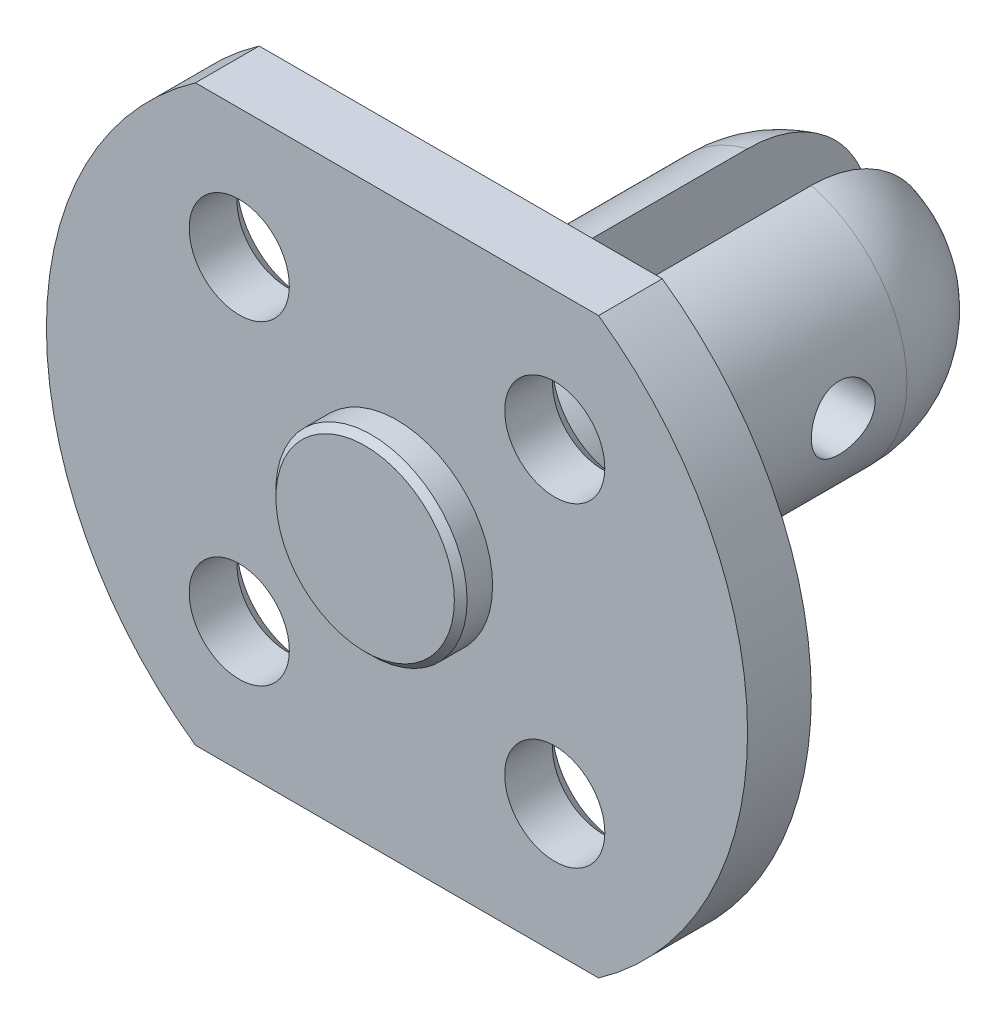
ISO-10303-21;
HEADER;
FILE_DESCRIPTION(('STEP AP214'),'2;1');
FILE_NAME('part.step','',(''),(''),'','','');
FILE_SCHEMA(('AUTOMOTIVE_DESIGN { 1 0 10303 214 1 1 1 1 }'));
ENDSEC;
DATA;
#1=APPLICATION_CONTEXT('core data for automotive mechanical design processes');
#2=APPLICATION_PROTOCOL_DEFINITION('international standard','automotive_design',2000,#1);
#3=PRODUCT_CONTEXT('',#1,'mechanical');
#4=PRODUCT('Part','Part','',(#3));
#5=PRODUCT_RELATED_PRODUCT_CATEGORY('part','',(#4));
#6=PRODUCT_DEFINITION_FORMATION('','',#4);
#7=PRODUCT_DEFINITION_CONTEXT('part definition',#1,'design');
#8=PRODUCT_DEFINITION('design','',#6,#7);
#9=PRODUCT_DEFINITION_SHAPE('','',#8);
#10=(LENGTH_UNIT() NAMED_UNIT(*) SI_UNIT(.MILLI.,.METRE.));
#11=(NAMED_UNIT(*) PLANE_ANGLE_UNIT() SI_UNIT($,.RADIAN.));
#12=(NAMED_UNIT(*) SI_UNIT($,.STERADIAN.) SOLID_ANGLE_UNIT());
#13=UNCERTAINTY_MEASURE_WITH_UNIT(LENGTH_MEASURE(1.E-05),#10,'distance_accuracy_value','');
#14=(GEOMETRIC_REPRESENTATION_CONTEXT(3) GLOBAL_UNCERTAINTY_ASSIGNED_CONTEXT((#13)) GLOBAL_UNIT_ASSIGNED_CONTEXT((#10,
#11,#12)) REPRESENTATION_CONTEXT('',''));
#15=CARTESIAN_POINT('',(0.,0.,0.));
#16=DIRECTION('',(0.,0.,1.));
#17=DIRECTION('',(1.,0.,0.));
#18=AXIS2_PLACEMENT_3D('',#15,#16,#17);
#19=CARTESIAN_POINT('',(0.,0.,-10.));
#20=DIRECTION('',(0.,0.,1.));
#21=DIRECTION('',(1.,0.,0.));
#22=AXIS2_PLACEMENT_3D('',#19,#20,#21);
#23=SPHERICAL_SURFACE('',#22,4.);
#24=CARTESIAN_POINT('',(1.,0.,-10.));
#25=DIRECTION('',(1.,0.,0.));
#26=DIRECTION('',(0.,0.,-1.));
#27=AXIS2_PLACEMENT_3D('',#24,#25,#26);
#28=CIRCLE('',#27,3.87298334620742);
#29=CARTESIAN_POINT('',(1.,3.87298334620742,-10.));
#30=VERTEX_POINT('',#29);
#31=CARTESIAN_POINT('',(1.,-3.87298334620742,-10.));
#32=VERTEX_POINT('',#31);
#33=EDGE_CURVE('E215',#30,#32,#28,.F.);
#34=ORIENTED_EDGE('',*,*,#33,.F.);
#35=CARTESIAN_POINT('',(0.,0.,-10.));
#36=DIRECTION('',(0.,0.,1.));
#37=DIRECTION('',(1.,0.,0.));
#38=AXIS2_PLACEMENT_3D('',#35,#36,#37);
#39=CIRCLE('',#38,4.);
#40=EDGE_CURVE('E148',#32,#30,#39,.T.);
#41=ORIENTED_EDGE('',*,*,#40,.F.);
#42=EDGE_LOOP('',(#34,#41));
#43=FACE_BOUND('',#42,.T.);
#44=ADVANCED_FACE('F43',(#43),#23,.T.);
#45=CARTESIAN_POINT('',(0.,0.,2.));
#46=DIRECTION('',(0.,0.,-1.));
#47=DIRECTION('',(-1.,0.,0.));
#48=AXIS2_PLACEMENT_3D('',#45,#46,#47);
#49=CYLINDRICAL_SURFACE('',#48,11.);
#50=CARTESIAN_POINT('',(0.,0.,0.));
#51=DIRECTION('',(0.,0.,1.));
#52=DIRECTION('',(1.,0.,0.));
#53=AXIS2_PLACEMENT_3D('',#50,#51,#52);
#54=CIRCLE('',#53,11.);
#55=CARTESIAN_POINT('',(-6.32455532033676,8.99999999999999,0.));
#56=VERTEX_POINT('',#55);
#57=CARTESIAN_POINT('',(-6.32455532033675,-9.,0.));
#58=VERTEX_POINT('',#57);
#59=EDGE_CURVE('E166',#56,#58,#54,.T.);
#60=ORIENTED_EDGE('',*,*,#59,.T.);
#61=DIRECTION('',(0.,0.,-1.));
#62=VECTOR('',#61,1.);
#63=CARTESIAN_POINT('',(-6.32455532033675,-9.,2.));
#64=LINE('',#63,#62);
#65=CARTESIAN_POINT('',(-6.32455532033675,-9.,2.));
#66=VERTEX_POINT('',#65);
#67=EDGE_CURVE('E187',#66,#58,#64,.T.);
#68=ORIENTED_EDGE('',*,*,#67,.F.);
#69=CARTESIAN_POINT('',(0.,0.,2.));
#70=DIRECTION('',(0.,0.,1.));
#71=DIRECTION('',(1.,0.,0.));
#72=AXIS2_PLACEMENT_3D('',#69,#70,#71);
#73=CIRCLE('',#72,11.);
#74=CARTESIAN_POINT('',(-6.32455532033676,8.99999999999999,2.));
#75=VERTEX_POINT('',#74);
#76=EDGE_CURVE('E167',#75,#66,#73,.T.);
#77=ORIENTED_EDGE('',*,*,#76,.F.);
#78=DIRECTION('',(0.,0.,-1.));
#79=VECTOR('',#78,1.);
#80=CARTESIAN_POINT('',(-6.32455532033676,8.99999999999999,2.));
#81=LINE('',#80,#79);
#82=EDGE_CURVE('E173',#75,#56,#81,.T.);
#83=ORIENTED_EDGE('',*,*,#82,.T.);
#84=EDGE_LOOP('',(#60,#68,#77,#83));
#85=FACE_BOUND('',#84,.T.);
#86=ADVANCED_FACE('F235',(#85),#49,.T.);
#87=CARTESIAN_POINT('',(-6.32455532033675,-9.,2.));
#88=DIRECTION('',(0.,1.,0.));
#89=DIRECTION('',(-1.,0.,0.));
#90=AXIS2_PLACEMENT_3D('',#87,#88,#89);
#91=PLANE('',#90);
#92=DIRECTION('',(1.,0.,0.));
#93=VECTOR('',#92,1.);
#94=CARTESIAN_POINT('',(-6.32455532033675,-9.,0.));
#95=LINE('',#94,#93);
#96=CARTESIAN_POINT('',(6.32455532033675,-9.,0.));
#97=VERTEX_POINT('',#96);
#98=EDGE_CURVE('E176',#58,#97,#95,.T.);
#99=ORIENTED_EDGE('',*,*,#98,.T.);
#100=DIRECTION('',(0.,0.,-1.));
#101=VECTOR('',#100,1.);
#102=CARTESIAN_POINT('',(6.32455532033675,-9.,2.));
#103=LINE('',#102,#101);
#104=CARTESIAN_POINT('',(6.32455532033675,-9.,2.));
#105=VERTEX_POINT('',#104);
#106=EDGE_CURVE('E184',#105,#97,#103,.T.);
#107=ORIENTED_EDGE('',*,*,#106,.F.);
#108=DIRECTION('',(1.,0.,0.));
#109=VECTOR('',#108,1.);
#110=CARTESIAN_POINT('',(-6.32455532033675,-9.,2.));
#111=LINE('',#110,#109);
#112=EDGE_CURVE('E97',#66,#105,#111,.T.);
#113=ORIENTED_EDGE('',*,*,#112,.F.);
#114=ORIENTED_EDGE('',*,*,#67,.T.);
#115=EDGE_LOOP('',(#99,#107,#113,#114));
#116=FACE_BOUND('',#115,.T.);
#117=ADVANCED_FACE('F242',(#116),#91,.F.);
#118=CARTESIAN_POINT('',(0.,0.,2.));
#119=DIRECTION('',(0.,0.,-1.));
#120=DIRECTION('',(-1.,0.,0.));
#121=AXIS2_PLACEMENT_3D('',#118,#119,#120);
#122=CYLINDRICAL_SURFACE('',#121,11.);
#123=CARTESIAN_POINT('',(0.,0.,0.));
#124=DIRECTION('',(0.,0.,1.));
#125=DIRECTION('',(1.,0.,0.));
#126=AXIS2_PLACEMENT_3D('',#123,#124,#125);
#127=CIRCLE('',#126,11.);
#128=CARTESIAN_POINT('',(6.32455532033676,9.,0.));
#129=VERTEX_POINT('',#128);
#130=EDGE_CURVE('E178',#97,#129,#127,.T.);
#131=ORIENTED_EDGE('',*,*,#130,.T.);
#132=DIRECTION('',(0.,0.,-1.));
#133=VECTOR('',#132,1.);
#134=CARTESIAN_POINT('',(6.32455532033676,9.,2.));
#135=LINE('',#134,#133);
#136=CARTESIAN_POINT('',(6.32455532033676,9.,2.));
#137=VERTEX_POINT('',#136);
#138=EDGE_CURVE('E182',#137,#129,#135,.T.);
#139=ORIENTED_EDGE('',*,*,#138,.F.);
#140=CARTESIAN_POINT('',(0.,0.,2.));
#141=DIRECTION('',(0.,0.,1.));
#142=DIRECTION('',(1.,0.,0.));
#143=AXIS2_PLACEMENT_3D('',#140,#141,#142);
#144=CIRCLE('',#143,11.);
#145=EDGE_CURVE('E170',#105,#137,#144,.T.);
#146=ORIENTED_EDGE('',*,*,#145,.F.);
#147=ORIENTED_EDGE('',*,*,#106,.T.);
#148=EDGE_LOOP('',(#131,#139,#146,#147));
#149=FACE_BOUND('',#148,.T.);
#150=ADVANCED_FACE('F325',(#149),#122,.T.);
#151=CARTESIAN_POINT('',(-6.32455532033676,8.99999999999999,2.));
#152=DIRECTION('',(0.,-1.,0.));
#153=DIRECTION('',(1.,0.,0.));
#154=AXIS2_PLACEMENT_3D('',#151,#152,#153);
#155=PLANE('',#154);
#156=DIRECTION('',(-1.,0.,0.));
#157=VECTOR('',#156,1.);
#158=CARTESIAN_POINT('',(-6.32455532033676,8.99999999999999,0.));
#159=LINE('',#158,#157);
#160=EDGE_CURVE('E89',#129,#56,#159,.T.);
#161=ORIENTED_EDGE('',*,*,#160,.T.);
#162=ORIENTED_EDGE('',*,*,#82,.F.);
#163=DIRECTION('',(-1.,0.,0.));
#164=VECTOR('',#163,1.);
#165=CARTESIAN_POINT('',(-6.32455532033676,8.99999999999999,2.));
#166=LINE('',#165,#164);
#167=EDGE_CURVE('E68',#137,#75,#166,.T.);
#168=ORIENTED_EDGE('',*,*,#167,.F.);
#169=ORIENTED_EDGE('',*,*,#138,.T.);
#170=EDGE_LOOP('',(#161,#162,#168,#169));
#171=FACE_BOUND('',#170,.T.);
#172=ADVANCED_FACE('F309',(#171),#155,.F.);
#173=CARTESIAN_POINT('',(0.,0.,2.));
#174=DIRECTION('',(0.,0.,1.));
#175=DIRECTION('',(1.,0.,0.));
#176=AXIS2_PLACEMENT_3D('',#173,#174,#175);
#177=PLANE('',#176);
#178=CARTESIAN_POINT('',(0.,0.,2.));
#179=DIRECTION('',(0.,0.,1.));
#180=DIRECTION('',(1.,0.,0.));
#181=AXIS2_PLACEMENT_3D('',#178,#179,#180);
#182=CIRCLE('',#181,3.);
#183=CARTESIAN_POINT('',(3.,0.,2.));
#184=VERTEX_POINT('',#183);
#185=EDGE_CURVE('E220',#184,#184,#182,.T.);
#186=ORIENTED_EDGE('',*,*,#185,.F.);
#187=EDGE_LOOP('',(#186));
#188=FACE_BOUND('',#187,.T.);
#189=CARTESIAN_POINT('',(-4.94974746830577,4.94974746830589,2.));
#190=DIRECTION('',(0.,0.,1.));
#191=DIRECTION('',(1.,0.,0.));
#192=AXIS2_PLACEMENT_3D('',#189,#190,#191);
#193=CIRCLE('',#192,1.571161348862);
#194=CARTESIAN_POINT('',(-3.37858611944377,4.94974746830589,2.));
#195=VERTEX_POINT('',#194);
#196=EDGE_CURVE('E154',#195,#195,#193,.T.);
#197=ORIENTED_EDGE('',*,*,#196,.F.);
#198=EDGE_LOOP('',(#197));
#199=FACE_BOUND('',#198,.T.);
#200=CARTESIAN_POINT('',(-4.94974746830588,-4.94974746830579,2.));
#201=DIRECTION('',(0.,0.,1.));
#202=DIRECTION('',(1.,0.,0.));
#203=AXIS2_PLACEMENT_3D('',#200,#201,#202);
#204=CIRCLE('',#203,1.57116134886201);
#205=CARTESIAN_POINT('',(-3.37858611944387,-4.94974746830579,2.));
#206=VERTEX_POINT('',#205);
#207=EDGE_CURVE('E159',#206,#206,#204,.T.);
#208=ORIENTED_EDGE('',*,*,#207,.F.);
#209=EDGE_LOOP('',(#208));
#210=FACE_BOUND('',#209,.T.);
#211=CARTESIAN_POINT('',(4.94974746830581,-4.94974746830586,2.));
#212=DIRECTION('',(0.,0.,1.));
#213=DIRECTION('',(1.,0.,0.));
#214=AXIS2_PLACEMENT_3D('',#211,#212,#213);
#215=CIRCLE('',#214,1.57116134886201);
#216=CARTESIAN_POINT('',(6.52090881716781,-4.94974746830586,2.));
#217=VERTEX_POINT('',#216);
#218=EDGE_CURVE('E155',#217,#217,#215,.T.);
#219=ORIENTED_EDGE('',*,*,#218,.F.);
#220=EDGE_LOOP('',(#219));
#221=FACE_BOUND('',#220,.T.);
#222=CARTESIAN_POINT('',(4.94974746830584,4.94974746830582,2.));
#223=DIRECTION('',(0.,0.,1.));
#224=DIRECTION('',(1.,0.,0.));
#225=AXIS2_PLACEMENT_3D('',#222,#223,#224);
#226=CIRCLE('',#225,1.57116134886201);
#227=CARTESIAN_POINT('',(6.52090881716785,4.94974746830582,2.));
#228=VERTEX_POINT('',#227);
#229=EDGE_CURVE('E158',#228,#228,#226,.T.);
#230=ORIENTED_EDGE('',*,*,#229,.F.);
#231=EDGE_LOOP('',(#230));
#232=FACE_BOUND('',#231,.T.);
#233=ORIENTED_EDGE('',*,*,#76,.T.);
#234=ORIENTED_EDGE('',*,*,#112,.T.);
#235=ORIENTED_EDGE('',*,*,#145,.T.);
#236=ORIENTED_EDGE('',*,*,#167,.T.);
#237=EDGE_LOOP('',(#233,#234,#235,#236));
#238=FACE_BOUND('',#237,.T.);
#239=ADVANCED_FACE('F305',(#188,#199,#210,#221,#232,#238),#177,.T.);
#240=CARTESIAN_POINT('',(0.,0.,0.));
#241=DIRECTION('',(0.,0.,1.));
#242=DIRECTION('',(1.,0.,0.));
#243=AXIS2_PLACEMENT_3D('',#240,#241,#242);
#244=PLANE('',#243);
#245=CARTESIAN_POINT('',(0.,0.,0.));
#246=DIRECTION('',(0.,0.,1.));
#247=DIRECTION('',(1.,0.,0.));
#248=AXIS2_PLACEMENT_3D('',#245,#246,#247);
#249=CIRCLE('',#248,4.);
#250=CARTESIAN_POINT('',(4.,0.,0.));
#251=VERTEX_POINT('',#250);
#252=EDGE_CURVE('E151',#251,#251,#249,.T.);
#253=ORIENTED_EDGE('',*,*,#252,.T.);
#254=EDGE_LOOP('',(#253));
#255=FACE_BOUND('',#254,.T.);
#256=CARTESIAN_POINT('',(-4.94974746830577,4.94974746830589,0.));
#257=DIRECTION('',(0.,0.,1.));
#258=DIRECTION('',(1.,0.,0.));
#259=AXIS2_PLACEMENT_3D('',#256,#257,#258);
#260=CIRCLE('',#259,2.071161348862);
#261=CARTESIAN_POINT('',(-2.87858611944377,4.94974746830589,0.));
#262=VERTEX_POINT('',#261);
#263=EDGE_CURVE('E198',#262,#262,#260,.T.);
#264=ORIENTED_EDGE('',*,*,#263,.T.);
#265=EDGE_LOOP('',(#264));
#266=FACE_BOUND('',#265,.T.);
#267=CARTESIAN_POINT('',(-4.94974746830588,-4.94974746830579,0.));
#268=DIRECTION('',(0.,0.,1.));
#269=DIRECTION('',(1.,0.,0.));
#270=AXIS2_PLACEMENT_3D('',#267,#268,#269);
#271=CIRCLE('',#270,2.071161348862);
#272=CARTESIAN_POINT('',(-2.87858611944387,-4.94974746830579,0.));
#273=VERTEX_POINT('',#272);
#274=EDGE_CURVE('E195',#273,#273,#271,.T.);
#275=ORIENTED_EDGE('',*,*,#274,.T.);
#276=EDGE_LOOP('',(#275));
#277=FACE_BOUND('',#276,.T.);
#278=CARTESIAN_POINT('',(4.94974746830581,-4.94974746830586,0.));
#279=DIRECTION('',(0.,0.,1.));
#280=DIRECTION('',(1.,0.,0.));
#281=AXIS2_PLACEMENT_3D('',#278,#279,#280);
#282=CIRCLE('',#281,2.071161348862);
#283=CARTESIAN_POINT('',(7.02090881716781,-4.94974746830586,0.));
#284=VERTEX_POINT('',#283);
#285=EDGE_CURVE('E192',#284,#284,#282,.T.);
#286=ORIENTED_EDGE('',*,*,#285,.T.);
#287=EDGE_LOOP('',(#286));
#288=FACE_BOUND('',#287,.T.);
#289=CARTESIAN_POINT('',(4.94974746830584,4.94974746830582,0.));
#290=DIRECTION('',(0.,0.,1.));
#291=DIRECTION('',(1.,0.,0.));
#292=AXIS2_PLACEMENT_3D('',#289,#290,#291);
#293=CIRCLE('',#292,2.071161348862);
#294=CARTESIAN_POINT('',(7.02090881716784,4.94974746830582,0.));
#295=VERTEX_POINT('',#294);
#296=EDGE_CURVE('E189',#295,#295,#293,.T.);
#297=ORIENTED_EDGE('',*,*,#296,.T.);
#298=EDGE_LOOP('',(#297));
#299=FACE_BOUND('',#298,.T.);
#300=ORIENTED_EDGE('',*,*,#59,.F.);
#301=ORIENTED_EDGE('',*,*,#160,.F.);
#302=ORIENTED_EDGE('',*,*,#130,.F.);
#303=ORIENTED_EDGE('',*,*,#98,.F.);
#304=EDGE_LOOP('',(#300,#301,#302,#303));
#305=FACE_BOUND('',#304,.T.);
#306=ADVANCED_FACE('F308',(#255,#266,#277,#288,#299,#305),#244,.F.);
#307=CARTESIAN_POINT('',(4.94974746830584,4.94974746830582,0.));
#308=DIRECTION('',(0.,0.,1.));
#309=DIRECTION('',(1.,0.,0.));
#310=AXIS2_PLACEMENT_3D('',#307,#308,#309);
#311=CYLINDRICAL_SURFACE('',#310,1.57116134886201);
#312=CARTESIAN_POINT('',(4.94974746830584,4.94974746830582,0.500000000000003));
#313=DIRECTION('',(0.,0.,1.));
#314=DIRECTION('',(1.,0.,0.));
#315=AXIS2_PLACEMENT_3D('',#312,#313,#314);
#316=CIRCLE('',#315,1.57116134886201);
#317=CARTESIAN_POINT('',(6.52090881716785,4.94974746830582,0.500000000000003));
#318=VERTEX_POINT('',#317);
#319=EDGE_CURVE('E210',#318,#318,#316,.F.);
#320=ORIENTED_EDGE('',*,*,#319,.T.);
#321=EDGE_LOOP('',(#320));
#322=FACE_BOUND('',#321,.T.);
#323=ORIENTED_EDGE('',*,*,#229,.T.);
#324=EDGE_LOOP('',(#323));
#325=FACE_BOUND('',#324,.T.);
#326=ADVANCED_FACE('F328',(#322,#325),#311,.F.);
#327=CARTESIAN_POINT('',(4.94974746830581,-4.94974746830586,0.));
#328=DIRECTION('',(0.,0.,1.));
#329=DIRECTION('',(1.,0.,0.));
#330=AXIS2_PLACEMENT_3D('',#327,#328,#329);
#331=CYLINDRICAL_SURFACE('',#330,1.57116134886201);
#332=CARTESIAN_POINT('',(4.94974746830581,-4.94974746830586,0.500000000000003));
#333=DIRECTION('',(0.,0.,1.));
#334=DIRECTION('',(1.,0.,0.));
#335=AXIS2_PLACEMENT_3D('',#332,#333,#334);
#336=CIRCLE('',#335,1.57116134886201);
#337=CARTESIAN_POINT('',(6.52090881716781,-4.94974746830586,0.500000000000003));
#338=VERTEX_POINT('',#337);
#339=EDGE_CURVE('E207',#338,#338,#336,.F.);
#340=ORIENTED_EDGE('',*,*,#339,.T.);
#341=EDGE_LOOP('',(#340));
#342=FACE_BOUND('',#341,.T.);
#343=ORIENTED_EDGE('',*,*,#218,.T.);
#344=EDGE_LOOP('',(#343));
#345=FACE_BOUND('',#344,.T.);
#346=ADVANCED_FACE('F334',(#342,#345),#331,.F.);
#347=CARTESIAN_POINT('',(-4.94974746830588,-4.94974746830579,0.));
#348=DIRECTION('',(0.,0.,1.));
#349=DIRECTION('',(1.,0.,0.));
#350=AXIS2_PLACEMENT_3D('',#347,#348,#349);
#351=CYLINDRICAL_SURFACE('',#350,1.57116134886201);
#352=CARTESIAN_POINT('',(-4.94974746830588,-4.94974746830579,0.500000000000003));
#353=DIRECTION('',(0.,0.,1.));
#354=DIRECTION('',(1.,0.,0.));
#355=AXIS2_PLACEMENT_3D('',#352,#353,#354);
#356=CIRCLE('',#355,1.57116134886201);
#357=CARTESIAN_POINT('',(-3.37858611944387,-4.94974746830579,0.500000000000003));
#358=VERTEX_POINT('',#357);
#359=EDGE_CURVE('E204',#358,#358,#356,.F.);
#360=ORIENTED_EDGE('',*,*,#359,.T.);
#361=EDGE_LOOP('',(#360));
#362=FACE_BOUND('',#361,.T.);
#363=ORIENTED_EDGE('',*,*,#207,.T.);
#364=EDGE_LOOP('',(#363));
#365=FACE_BOUND('',#364,.T.);
#366=ADVANCED_FACE('F520',(#362,#365),#351,.F.);
#367=CARTESIAN_POINT('',(-4.94974746830577,4.94974746830589,0.));
#368=DIRECTION('',(0.,0.,1.));
#369=DIRECTION('',(1.,0.,0.));
#370=AXIS2_PLACEMENT_3D('',#367,#368,#369);
#371=CYLINDRICAL_SURFACE('',#370,1.571161348862);
#372=CARTESIAN_POINT('',(-4.94974746830577,4.94974746830589,0.500000000000004));
#373=DIRECTION('',(0.,0.,1.));
#374=DIRECTION('',(1.,0.,0.));
#375=AXIS2_PLACEMENT_3D('',#372,#373,#374);
#376=CIRCLE('',#375,1.571161348862);
#377=CARTESIAN_POINT('',(-3.37858611944377,4.94974746830589,0.500000000000004));
#378=VERTEX_POINT('',#377);
#379=EDGE_CURVE('E201',#378,#378,#376,.F.);
#380=ORIENTED_EDGE('',*,*,#379,.T.);
#381=EDGE_LOOP('',(#380));
#382=FACE_BOUND('',#381,.T.);
#383=ORIENTED_EDGE('',*,*,#196,.T.);
#384=EDGE_LOOP('',(#383));
#385=FACE_BOUND('',#384,.T.);
#386=ADVANCED_FACE('F353',(#382,#385),#371,.F.);
#387=CARTESIAN_POINT('',(-4.94974746830577,4.94974746830589,0.));
#388=DIRECTION('',(0.,0.,-1.));
#389=DIRECTION('',(-1.,0.,0.));
#390=AXIS2_PLACEMENT_3D('',#387,#388,#389);
#391=CONICAL_SURFACE('',#390,2.071161348862,0.785398163397443);
#392=ORIENTED_EDGE('',*,*,#379,.F.);
#393=EDGE_LOOP('',(#392));
#394=FACE_BOUND('',#393,.T.);
#395=ORIENTED_EDGE('',*,*,#263,.F.);
#396=EDGE_LOOP('',(#395));
#397=FACE_BOUND('',#396,.T.);
#398=ADVANCED_FACE('F346',(#394,#397),#391,.F.);
#399=CARTESIAN_POINT('',(-4.94974746830588,-4.94974746830579,0.));
#400=DIRECTION('',(0.,0.,-1.));
#401=DIRECTION('',(-1.,0.,0.));
#402=AXIS2_PLACEMENT_3D('',#399,#400,#401);
#403=CONICAL_SURFACE('',#402,2.071161348862,0.785398163397444);
#404=ORIENTED_EDGE('',*,*,#359,.F.);
#405=EDGE_LOOP('',(#404));
#406=FACE_BOUND('',#405,.T.);
#407=ORIENTED_EDGE('',*,*,#274,.F.);
#408=EDGE_LOOP('',(#407));
#409=FACE_BOUND('',#408,.T.);
#410=ADVANCED_FACE('F352',(#406,#409),#403,.F.);
#411=CARTESIAN_POINT('',(4.94974746830581,-4.94974746830586,0.));
#412=DIRECTION('',(0.,0.,-1.));
#413=DIRECTION('',(-1.,0.,0.));
#414=AXIS2_PLACEMENT_3D('',#411,#412,#413);
#415=CONICAL_SURFACE('',#414,2.071161348862,0.785398163397443);
#416=ORIENTED_EDGE('',*,*,#339,.F.);
#417=EDGE_LOOP('',(#416));
#418=FACE_BOUND('',#417,.T.);
#419=ORIENTED_EDGE('',*,*,#285,.F.);
#420=EDGE_LOOP('',(#419));
#421=FACE_BOUND('',#420,.T.);
#422=ADVANCED_FACE('F360',(#418,#421),#415,.F.);
#423=CARTESIAN_POINT('',(4.94974746830584,4.94974746830582,0.));
#424=DIRECTION('',(0.,0.,-1.));
#425=DIRECTION('',(-1.,0.,0.));
#426=AXIS2_PLACEMENT_3D('',#423,#424,#425);
#427=CONICAL_SURFACE('',#426,2.071161348862,0.785398163397443);
#428=ORIENTED_EDGE('',*,*,#319,.F.);
#429=EDGE_LOOP('',(#428));
#430=FACE_BOUND('',#429,.T.);
#431=ORIENTED_EDGE('',*,*,#296,.F.);
#432=EDGE_LOOP('',(#431));
#433=FACE_BOUND('',#432,.T.);
#434=ADVANCED_FACE('F256',(#430,#433),#427,.F.);
#435=CARTESIAN_POINT('',(0.,0.,0.));
#436=DIRECTION('',(0.,0.,1.));
#437=DIRECTION('',(1.,0.,0.));
#438=AXIS2_PLACEMENT_3D('',#435,#436,#437);
#439=CYLINDRICAL_SURFACE('',#438,4.);
#440=CARTESIAN_POINT('',(4.,0.,-9.));
#441=CARTESIAN_POINT('',(3.99999906578675,0.0552507257798208,-8.9999984495079));
#442=CARTESIAN_POINT('',(3.99884385421219,0.110518771887176,-8.99540563281747));
#443=CARTESIAN_POINT('',(3.99434742553261,0.219470882513688,-8.977183232462));
#444=CARTESIAN_POINT('',(3.99100496946646,0.273154031247159,-8.96354852697477));
#445=CARTESIAN_POINT('',(3.98250417554693,0.377347248121718,-8.92770716435861));
#446=CARTESIAN_POINT('',(3.97734801894725,0.42786104228667,-8.90551080085648));
#447=CARTESIAN_POINT('',(3.96576895871729,0.524448087936285,-8.85321240663678));
#448=CARTESIAN_POINT('',(3.95934601236034,0.57052118956584,-8.82311010925404));
#449=CARTESIAN_POINT('',(3.94578275727868,0.657867951533947,-8.75519947356386));
#450=CARTESIAN_POINT('',(3.93863138099022,0.699037126707382,-8.71725895002722));
#451=CARTESIAN_POINT('',(3.92449080078353,0.774499284802204,-8.63503186339406));
#452=CARTESIAN_POINT('',(3.91750161525566,0.808791491299424,-8.59074458470234));
#453=CARTESIAN_POINT('',(3.9043651713314,0.870017695199356,-8.49626984884171));
#454=CARTESIAN_POINT('',(3.89823196313737,0.896834810616906,-8.44600451279306));
#455=CARTESIAN_POINT('',(3.88766329874815,0.941597939033686,-8.34150105889443));
#456=CARTESIAN_POINT('',(3.88322757115192,0.95954537029289,-8.28726357778283));
#457=CARTESIAN_POINT('',(3.87666984478367,0.985703224536195,-8.17750433453168));
#458=CARTESIAN_POINT('',(3.87450327383617,0.994101512222227,-8.12203006930013));
#459=CARTESIAN_POINT('',(3.8725957502516,1.00150785004524,-8.01042095399068));
#460=CARTESIAN_POINT('',(3.87285440299096,1.00051742787865,-7.95428621286759));
#461=CARTESIAN_POINT('',(3.87572803664412,0.989324349759522,-7.84438946150368));
#462=CARTESIAN_POINT('',(3.87828575334586,0.979345560127015,-7.79060291902327));
#463=CARTESIAN_POINT('',(3.88537806450989,0.950816124602073,-7.68549263272581));
#464=CARTESIAN_POINT('',(3.88991279980464,0.932264868046284,-7.63416906464734));
#465=CARTESIAN_POINT('',(3.90050075936124,0.886926318624771,-7.53484132249862));
#466=CARTESIAN_POINT('',(3.90656884979614,0.860057778155275,-7.48687588547363));
#467=CARTESIAN_POINT('',(3.91953140564257,0.798904184009971,-7.39605419349544));
#468=CARTESIAN_POINT('',(3.9264260155649,0.764617832539227,-7.35319883462183));
#469=CARTESIAN_POINT('',(3.94050587026521,0.688442283120813,-7.2725309228704));
#470=CARTESIAN_POINT('',(3.94769379651981,0.646364172110574,-7.23489700662577));
#471=CARTESIAN_POINT('',(3.96137310385857,0.556407945002467,-7.1671858383574));
#472=CARTESIAN_POINT('',(3.96786446366277,0.508529651805296,-7.13710881715762));
#473=CARTESIAN_POINT('',(3.97945154729455,0.408077259120928,-7.08529960918374));
#474=CARTESIAN_POINT('',(3.9845424008515,0.355487595472416,-7.06359643983038));
#475=CARTESIAN_POINT('',(3.99271944660946,0.247250672095255,-7.02938846286028));
#476=CARTESIAN_POINT('',(3.99580602226187,0.191603999433656,-7.01688189572124));
#477=CARTESIAN_POINT('',(3.9995699951425,0.0803599802600176,-7.00169495629411));
#478=CARTESIAN_POINT('',(4.00030702338852,0.0247978133254729,-6.9987713159498));
#479=CARTESIAN_POINT('',(3.999458698763,-0.086021916534339,-7.00216600137032));
#480=CARTESIAN_POINT('',(3.99787355494564,-0.14127950642973,-7.00848349519942));
#481=CARTESIAN_POINT('',(3.99259720751571,-0.249076179184328,-7.02998060559425));
#482=CARTESIAN_POINT('',(3.98893756123874,-0.301643412645837,-7.04502750898466));
#483=CARTESIAN_POINT('',(3.97992471089423,-0.403504861635008,-7.08340472268563));
#484=CARTESIAN_POINT('',(3.97457133579928,-0.452798746021757,-7.10673586954211));
#485=CARTESIAN_POINT('',(3.96262205284207,-0.547682089619899,-7.16149075258315));
#486=CARTESIAN_POINT('',(3.95600578244621,-0.593190294557221,-7.19305074159784));
#487=CARTESIAN_POINT('',(3.94229672791613,-0.678351075762165,-7.26319327253131));
#488=CARTESIAN_POINT('',(3.93520386167803,-0.718002639315339,-7.30177702641127));
#489=CARTESIAN_POINT('',(3.92112637973847,-0.791327045381821,-7.38600130722964));
#490=CARTESIAN_POINT('',(3.91414869458187,-0.824829245081356,-7.43179180200161));
#491=CARTESIAN_POINT('',(3.90128585584826,-0.8836738393418,-7.52848842297714));
#492=CARTESIAN_POINT('',(3.89540065378017,-0.909016596105292,-7.57939432197317));
#493=CARTESIAN_POINT('',(3.88545396489777,-0.950634280406196,-7.68460381494205));
#494=CARTESIAN_POINT('',(3.88138170194604,-0.966962931102711,-7.73888508556267));
#495=CARTESIAN_POINT('',(3.87551162726789,-0.990230439969187,-7.84953975859274));
#496=CARTESIAN_POINT('',(3.87371331813291,-0.99717135165244,-7.90591270068833));
#497=CARTESIAN_POINT('',(3.87263267469304,-1.00135906022266,-8.01741401590347));
#498=CARTESIAN_POINT('',(3.87327955152176,-0.99887859852008,-8.07253162341649));
#499=CARTESIAN_POINT('',(3.87685272671895,-0.984918185541912,-8.18153592577866));
#500=CARTESIAN_POINT('',(3.87977897927904,-0.973438415124514,-8.23542264534244));
#501=CARTESIAN_POINT('',(3.88754173788482,-0.941954212961864,-8.34013897271027));
#502=CARTESIAN_POINT('',(3.89236676824206,-0.922000936453585,-8.39098487016014));
#503=CARTESIAN_POINT('',(3.90338503816552,-0.874176609070048,-8.48864358847579));
#504=CARTESIAN_POINT('',(3.90957846747182,-0.846304460022794,-8.53545584879128));
#505=CARTESIAN_POINT('',(3.92283756175675,-0.782578499091425,-8.62503641933468));
#506=CARTESIAN_POINT('',(3.92992176554505,-0.746535441941504,-8.66766738228264));
#507=CARTESIAN_POINT('',(3.94405351497524,-0.667859580793158,-8.74636469653027));
#508=CARTESIAN_POINT('',(3.95110105151373,-0.625225214174098,-8.78242948674198));
#509=CARTESIAN_POINT('',(3.96451770431775,-0.533645057801728,-8.84760753904307));
#510=CARTESIAN_POINT('',(3.97087222243912,-0.484598948210926,-8.87658307578105));
#511=CARTESIAN_POINT('',(3.98203283316746,-0.382177373006985,-8.92583164196036));
#512=CARTESIAN_POINT('',(3.98684003466521,-0.328805042291161,-8.94611090709903));
#513=CARTESIAN_POINT('',(3.99365373043694,-0.229606835495649,-8.97438122021977));
#514=CARTESIAN_POINT('',(3.9960172336846,-0.184253447272047,-8.98396749536896));
#515=CARTESIAN_POINT('',(3.99919070154632,-0.092604047690856,-8.99677729574796));
#516=CARTESIAN_POINT('',(4.00000078300596,-0.0463081074950778,-9.00000129953687));
#517=CARTESIAN_POINT('',(4.,0.,-9.));
#518=B_SPLINE_CURVE_WITH_KNOTS('',3,(#440,#441,#442,#443,#444,#445,#446,#447,#448,#449,#450,
#451,#452,#453,#454,#455,#456,#457,#458,#459,#460,#461,#462,#463,#464,#465,#466,#467,#468,#469,
#470,#471,#472,#473,#474,#475,#476,#477,#478,#479,#480,#481,#482,#483,#484,#485,#486,#487,#488,
#489,#490,#491,#492,#493,#494,#495,#496,#497,#498,#499,#500,#501,#502,#503,#504,#505,#506,#507,
#508,#509,#510,#511,#512,#513,#514,#515,#516,#517),.UNSPECIFIED.,.T.,.F.,(4,2,2,2,2,2,2,2,2,2,2,
2,2,2,2,2,2,2,2,2,2,2,2,2,2,2,2,2,2,2,2,2,2,2,2,2,2,2,4),(0.,0.16558247498126,0.331258825175933,
0.496736601524071,0.662219960112886,0.830762902914261,0.999324863867081,1.17039098363871,
1.34142974112912,1.50904196732954,1.67662692075131,1.84014998004679,2.00368468977359,
2.16887018582586,2.33408460557442,2.50401000646013,2.67394059705498,2.84445486006076,
3.01493649125762,3.18105539299518,3.34715934075162,3.51080183009359,3.67446084881527,
3.84102391710235,4.0076157533868,4.17829672802984,4.34897012499672,4.51861503076025,
4.68822282168272,4.85295853599076,5.0176909397069,5.18144267039632,5.34521712091268,
5.51326384273274,5.68135046513612,5.85248123666393,6.02348909214234,6.16228161961433,
6.30106370695361),.UNSPECIFIED.);
#519=CARTESIAN_POINT('',(4.,0.,-9.));
#520=VERTEX_POINT('',#519);
#521=EDGE_CURVE('E134',#520,#520,#518,.T.);
#522=ORIENTED_EDGE('',*,*,#521,.F.);
#523=EDGE_LOOP('',(#522));
#524=FACE_BOUND('',#523,.T.);
#525=CARTESIAN_POINT('',(-4.,0.,-9.));
#526=CARTESIAN_POINT('',(-3.99999906578675,-0.0552507257798208,-8.9999984495079));
#527=CARTESIAN_POINT('',(-3.99884385421219,-0.110518771887176,-8.99540563281747));
#528=CARTESIAN_POINT('',(-3.99434742553261,-0.219470882513688,-8.977183232462));
#529=CARTESIAN_POINT('',(-3.99100496946646,-0.273154031247159,-8.96354852697477));
#530=CARTESIAN_POINT('',(-3.98250417554693,-0.377347248121718,-8.92770716435861));
#531=CARTESIAN_POINT('',(-3.97734801894725,-0.42786104228667,-8.90551080085648));
#532=CARTESIAN_POINT('',(-3.96576895871729,-0.524448087936285,-8.85321240663678));
#533=CARTESIAN_POINT('',(-3.95934601236034,-0.57052118956584,-8.82311010925404));
#534=CARTESIAN_POINT('',(-3.94578275727868,-0.657867951533947,-8.75519947356386));
#535=CARTESIAN_POINT('',(-3.93863138099022,-0.699037126707382,-8.71725895002722));
#536=CARTESIAN_POINT('',(-3.92449080078353,-0.774499284802204,-8.63503186339406));
#537=CARTESIAN_POINT('',(-3.91750161525566,-0.808791491299424,-8.59074458470234));
#538=CARTESIAN_POINT('',(-3.9043651713314,-0.870017695199356,-8.49626984884171));
#539=CARTESIAN_POINT('',(-3.89823196313737,-0.896834810616906,-8.44600451279306));
#540=CARTESIAN_POINT('',(-3.88766329874815,-0.941597939033686,-8.34150105889443));
#541=CARTESIAN_POINT('',(-3.88322757115192,-0.95954537029289,-8.28726357778283));
#542=CARTESIAN_POINT('',(-3.87666984478367,-0.985703224536195,-8.17750433453168));
#543=CARTESIAN_POINT('',(-3.87450327383617,-0.994101512222227,-8.12203006930013));
#544=CARTESIAN_POINT('',(-3.8725957502516,-1.00150785004524,-8.01042095399068));
#545=CARTESIAN_POINT('',(-3.87285440299096,-1.00051742787865,-7.95428621286759));
#546=CARTESIAN_POINT('',(-3.87572803664412,-0.989324349759522,-7.84438946150368));
#547=CARTESIAN_POINT('',(-3.87828575334586,-0.979345560127015,-7.79060291902327));
#548=CARTESIAN_POINT('',(-3.88537806450989,-0.950816124602073,-7.68549263272581));
#549=CARTESIAN_POINT('',(-3.88991279980464,-0.932264868046284,-7.63416906464734));
#550=CARTESIAN_POINT('',(-3.90050075936124,-0.886926318624771,-7.53484132249862));
#551=CARTESIAN_POINT('',(-3.90656884979614,-0.860057778155275,-7.48687588547363));
#552=CARTESIAN_POINT('',(-3.91953140564257,-0.798904184009971,-7.39605419349544));
#553=CARTESIAN_POINT('',(-3.9264260155649,-0.764617832539227,-7.35319883462183));
#554=CARTESIAN_POINT('',(-3.94050587026521,-0.688442283120813,-7.2725309228704));
#555=CARTESIAN_POINT('',(-3.94769379651981,-0.646364172110574,-7.23489700662577));
#556=CARTESIAN_POINT('',(-3.96137310385857,-0.556407945002467,-7.1671858383574));
#557=CARTESIAN_POINT('',(-3.96786446366277,-0.508529651805296,-7.13710881715762));
#558=CARTESIAN_POINT('',(-3.97945154729455,-0.408077259120928,-7.08529960918374));
#559=CARTESIAN_POINT('',(-3.9845424008515,-0.355487595472416,-7.06359643983038));
#560=CARTESIAN_POINT('',(-3.99271944660946,-0.247250672095255,-7.02938846286028));
#561=CARTESIAN_POINT('',(-3.99580602226187,-0.191603999433656,-7.01688189572124));
#562=CARTESIAN_POINT('',(-3.9995699951425,-0.0803599802600176,-7.00169495629411));
#563=CARTESIAN_POINT('',(-4.00030702338852,-0.0247978133254729,-6.9987713159498));
#564=CARTESIAN_POINT('',(-3.999458698763,0.086021916534339,-7.00216600137032));
#565=CARTESIAN_POINT('',(-3.99787355494564,0.14127950642973,-7.00848349519942));
#566=CARTESIAN_POINT('',(-3.99259720751571,0.249076179184328,-7.02998060559425));
#567=CARTESIAN_POINT('',(-3.98893756123874,0.301643412645837,-7.04502750898466));
#568=CARTESIAN_POINT('',(-3.97992471089423,0.403504861635008,-7.08340472268563));
#569=CARTESIAN_POINT('',(-3.97457133579928,0.452798746021757,-7.10673586954211));
#570=CARTESIAN_POINT('',(-3.96262205284207,0.547682089619899,-7.16149075258315));
#571=CARTESIAN_POINT('',(-3.95600578244621,0.593190294557221,-7.19305074159784));
#572=CARTESIAN_POINT('',(-3.94229672791613,0.678351075762165,-7.26319327253131));
#573=CARTESIAN_POINT('',(-3.93520386167803,0.718002639315339,-7.30177702641127));
#574=CARTESIAN_POINT('',(-3.92112637973847,0.791327045381821,-7.38600130722964));
#575=CARTESIAN_POINT('',(-3.91414869458187,0.824829245081356,-7.43179180200161));
#576=CARTESIAN_POINT('',(-3.90128585584826,0.8836738393418,-7.52848842297714));
#577=CARTESIAN_POINT('',(-3.89540065378017,0.909016596105292,-7.57939432197317));
#578=CARTESIAN_POINT('',(-3.88545396489777,0.950634280406196,-7.68460381494205));
#579=CARTESIAN_POINT('',(-3.88138170194604,0.966962931102711,-7.73888508556267));
#580=CARTESIAN_POINT('',(-3.87551162726789,0.990230439969187,-7.84953975859274));
#581=CARTESIAN_POINT('',(-3.87371331813291,0.99717135165244,-7.90591270068833));
#582=CARTESIAN_POINT('',(-3.87263267469304,1.00135906022266,-8.01741401590347));
#583=CARTESIAN_POINT('',(-3.87327955152176,0.99887859852008,-8.07253162341649));
#584=CARTESIAN_POINT('',(-3.87685272671895,0.984918185541912,-8.18153592577866));
#585=CARTESIAN_POINT('',(-3.87977897927904,0.973438415124514,-8.23542264534244));
#586=CARTESIAN_POINT('',(-3.88754173788482,0.941954212961864,-8.34013897271027));
#587=CARTESIAN_POINT('',(-3.89236676824206,0.922000936453585,-8.39098487016014));
#588=CARTESIAN_POINT('',(-3.90338503816552,0.874176609070048,-8.48864358847579));
#589=CARTESIAN_POINT('',(-3.90957846747182,0.846304460022794,-8.53545584879128));
#590=CARTESIAN_POINT('',(-3.92283756175675,0.782578499091425,-8.62503641933468));
#591=CARTESIAN_POINT('',(-3.92992176554505,0.746535441941504,-8.66766738228264));
#592=CARTESIAN_POINT('',(-3.94405351497524,0.667859580793158,-8.74636469653027));
#593=CARTESIAN_POINT('',(-3.95110105151373,0.625225214174098,-8.78242948674198));
#594=CARTESIAN_POINT('',(-3.96451770431775,0.533645057801728,-8.84760753904307));
#595=CARTESIAN_POINT('',(-3.97087222243912,0.484598948210926,-8.87658307578105));
#596=CARTESIAN_POINT('',(-3.98203283316746,0.382177373006985,-8.92583164196036));
#597=CARTESIAN_POINT('',(-3.98684003466521,0.328805042291161,-8.94611090709903));
#598=CARTESIAN_POINT('',(-3.99365373043694,0.229606835495649,-8.97438122021977));
#599=CARTESIAN_POINT('',(-3.9960172336846,0.184253447272047,-8.98396749536896));
#600=CARTESIAN_POINT('',(-3.99919070154632,0.092604047690856,-8.99677729574796));
#601=CARTESIAN_POINT('',(-4.00000078300596,0.0463081074950778,-9.00000129953687));
#602=CARTESIAN_POINT('',(-4.,0.,-9.));
#603=B_SPLINE_CURVE_WITH_KNOTS('',3,(#525,#526,#527,#528,#529,#530,#531,#532,#533,#534,#535,
#536,#537,#538,#539,#540,#541,#542,#543,#544,#545,#546,#547,#548,#549,#550,#551,#552,#553,#554,
#555,#556,#557,#558,#559,#560,#561,#562,#563,#564,#565,#566,#567,#568,#569,#570,#571,#572,#573,
#574,#575,#576,#577,#578,#579,#580,#581,#582,#583,#584,#585,#586,#587,#588,#589,#590,#591,#592,
#593,#594,#595,#596,#597,#598,#599,#600,#601,#602),.UNSPECIFIED.,.T.,.F.,(4,2,2,2,2,2,2,2,2,2,2,
2,2,2,2,2,2,2,2,2,2,2,2,2,2,2,2,2,2,2,2,2,2,2,2,2,2,2,4),(0.,0.16558247498126,0.331258825175933,
0.496736601524071,0.662219960112886,0.830762902914261,0.999324863867081,1.17039098363871,
1.34142974112912,1.50904196732954,1.67662692075131,1.84014998004679,2.00368468977359,
2.16887018582586,2.33408460557442,2.50401000646013,2.67394059705498,2.84445486006076,
3.01493649125762,3.18105539299518,3.34715934075162,3.51080183009359,3.67446084881527,
3.84102391710235,4.0076157533868,4.17829672802984,4.34897012499672,4.51861503076025,
4.68822282168272,4.85295853599076,5.0176909397069,5.18144267039632,5.34521712091268,
5.51326384273274,5.68135046513612,5.85248123666393,6.02348909214234,6.16228161961433,
6.30106370695361),.UNSPECIFIED.);
#604=CARTESIAN_POINT('',(-4.,0.,-9.));
#605=VERTEX_POINT('',#604);
#606=EDGE_CURVE('E268',#605,#605,#603,.T.);
#607=ORIENTED_EDGE('',*,*,#606,.F.);
#608=EDGE_LOOP('',(#607));
#609=FACE_BOUND('',#608,.T.);
#610=DIRECTION('',(0.,0.,1.));
#611=VECTOR('',#610,1.);
#612=CARTESIAN_POINT('',(1.,-3.87298334620742,0.));
#613=LINE('',#612,#611);
#614=CARTESIAN_POINT('',(1.,-3.87298334620742,-3.5));
#615=VERTEX_POINT('',#614);
#616=EDGE_CURVE('E141',#32,#615,#613,.T.);
#617=ORIENTED_EDGE('',*,*,#616,.F.);
#618=ORIENTED_EDGE('',*,*,#40,.T.);
#619=DIRECTION('',(0.,0.,1.));
#620=VECTOR('',#619,1.);
#621=CARTESIAN_POINT('',(1.,3.87298334620742,0.));
#622=LINE('',#621,#620);
#623=CARTESIAN_POINT('',(1.,3.87298334620742,-3.5));
#624=VERTEX_POINT('',#623);
#625=EDGE_CURVE('E143',#624,#30,#622,.F.);
#626=ORIENTED_EDGE('',*,*,#625,.F.);
#627=CARTESIAN_POINT('',(0.,0.,-3.5));
#628=DIRECTION('',(0.,0.,1.));
#629=DIRECTION('',(1.,0.,0.));
#630=AXIS2_PLACEMENT_3D('',#627,#628,#629);
#631=CIRCLE('',#630,4.);
#632=CARTESIAN_POINT('',(-1.,3.87298334620742,-3.5));
#633=VERTEX_POINT('',#632);
#634=EDGE_CURVE('E129',#633,#624,#631,.F.);
#635=ORIENTED_EDGE('',*,*,#634,.F.);
#636=DIRECTION('',(0.,0.,1.));
#637=VECTOR('',#636,1.);
#638=CARTESIAN_POINT('',(-1.,3.87298334620742,0.));
#639=LINE('',#638,#637);
#640=CARTESIAN_POINT('',(-0.999999999999999,3.87298334620742,-10.));
#641=VERTEX_POINT('',#640);
#642=EDGE_CURVE('E133',#641,#633,#639,.T.);
#643=ORIENTED_EDGE('',*,*,#642,.F.);
#644=CARTESIAN_POINT('',(-0.999999999999999,-3.87298334620742,-10.));
#645=VERTEX_POINT('',#644);
#646=EDGE_CURVE('E140',#641,#645,#39,.T.);
#647=ORIENTED_EDGE('',*,*,#646,.T.);
#648=DIRECTION('',(0.,0.,1.));
#649=VECTOR('',#648,1.);
#650=CARTESIAN_POINT('',(-1.,-3.87298334620742,0.));
#651=LINE('',#650,#649);
#652=CARTESIAN_POINT('',(-1.,-3.87298334620742,-3.5));
#653=VERTEX_POINT('',#652);
#654=EDGE_CURVE('E59',#653,#645,#651,.F.);
#655=ORIENTED_EDGE('',*,*,#654,.F.);
#656=EDGE_CURVE('E121',#615,#653,#631,.F.);
#657=ORIENTED_EDGE('',*,*,#656,.F.);
#658=EDGE_LOOP('',(#617,#618,#626,#635,#643,#647,#655,#657));
#659=FACE_BOUND('',#658,.T.);
#660=ORIENTED_EDGE('',*,*,#252,.F.);
#661=EDGE_LOOP('',(#660));
#662=FACE_BOUND('',#661,.T.);
#663=ADVANCED_FACE('F137',(#524,#609,#659,#662),#439,.T.);
#664=CARTESIAN_POINT('',(-0.999999999999999,0.,-10.));
#665=DIRECTION('',(-1.,0.,0.));
#666=DIRECTION('',(0.,0.,1.));
#667=AXIS2_PLACEMENT_3D('',#664,#665,#666);
#668=CIRCLE('',#667,3.87298334620742);
#669=EDGE_CURVE('E213',#645,#641,#668,.F.);
#670=ORIENTED_EDGE('',*,*,#669,.F.);
#671=ORIENTED_EDGE('',*,*,#646,.F.);
#672=EDGE_LOOP('',(#670,#671));
#673=FACE_BOUND('',#672,.T.);
#674=ADVANCED_FACE('F238',(#673),#23,.T.);
#675=CARTESIAN_POINT('',(1.,-13.5,-15.8528614157527));
#676=DIRECTION('',(1.,0.,0.));
#677=DIRECTION('',(0.,0.,-1.));
#678=AXIS2_PLACEMENT_3D('',#675,#676,#677);
#679=PLANE('',#678);
#680=CARTESIAN_POINT('',(1.,0.,-8.));
#681=DIRECTION('',(1.,0.,0.));
#682=DIRECTION('',(0.,0.,-1.));
#683=AXIS2_PLACEMENT_3D('',#680,#681,#682);
#684=CIRCLE('',#683,1.);
#685=CARTESIAN_POINT('',(1.,0.,-9.));
#686=VERTEX_POINT('',#685);
#687=EDGE_CURVE('E219',#686,#686,#684,.T.);
#688=ORIENTED_EDGE('',*,*,#687,.T.);
#689=EDGE_LOOP('',(#688));
#690=FACE_BOUND('',#689,.T.);
#691=ORIENTED_EDGE('',*,*,#625,.T.);
#692=ORIENTED_EDGE('',*,*,#33,.T.);
#693=ORIENTED_EDGE('',*,*,#616,.T.);
#694=DIRECTION('',(0.,1.,0.));
#695=VECTOR('',#694,1.);
#696=CARTESIAN_POINT('',(1.,-13.5,-3.5));
#697=LINE('',#696,#695);
#698=EDGE_CURVE('E126',#615,#624,#697,.T.);
#699=ORIENTED_EDGE('',*,*,#698,.T.);
#700=EDGE_LOOP('',(#691,#692,#693,#699));
#701=FACE_BOUND('',#700,.T.);
#702=ADVANCED_FACE('F249',(#690,#701),#679,.F.);
#703=CARTESIAN_POINT('',(-1.,-13.5,-3.5));
#704=DIRECTION('',(0.,0.,1.));
#705=DIRECTION('',(1.,0.,0.));
#706=AXIS2_PLACEMENT_3D('',#703,#704,#705);
#707=PLANE('',#706);
#708=ORIENTED_EDGE('',*,*,#656,.T.);
#709=DIRECTION('',(0.,1.,0.));
#710=VECTOR('',#709,1.);
#711=CARTESIAN_POINT('',(-1.,-13.5,-3.5));
#712=LINE('',#711,#710);
#713=EDGE_CURVE('E123',#653,#633,#712,.T.);
#714=ORIENTED_EDGE('',*,*,#713,.T.);
#715=ORIENTED_EDGE('',*,*,#634,.T.);
#716=ORIENTED_EDGE('',*,*,#698,.F.);
#717=EDGE_LOOP('',(#708,#714,#715,#716));
#718=FACE_BOUND('',#717,.T.);
#719=ADVANCED_FACE('F122',(#718),#707,.F.);
#720=CARTESIAN_POINT('',(-0.999999999999997,-13.5,-15.8528614157527));
#721=DIRECTION('',(-1.,0.,0.));
#722=DIRECTION('',(0.,0.,1.));
#723=AXIS2_PLACEMENT_3D('',#720,#721,#722);
#724=PLANE('',#723);
#725=CARTESIAN_POINT('',(-0.999999999999999,0.,-8.));
#726=DIRECTION('',(-1.,0.,0.));
#727=DIRECTION('',(0.,0.,1.));
#728=AXIS2_PLACEMENT_3D('',#725,#726,#727);
#729=CIRCLE('',#728,1.);
#730=CARTESIAN_POINT('',(-0.999999999999999,0.,-7.));
#731=VERTEX_POINT('',#730);
#732=EDGE_CURVE('E217',#731,#731,#729,.T.);
#733=ORIENTED_EDGE('',*,*,#732,.T.);
#734=EDGE_LOOP('',(#733));
#735=FACE_BOUND('',#734,.T.);
#736=ORIENTED_EDGE('',*,*,#654,.T.);
#737=ORIENTED_EDGE('',*,*,#669,.T.);
#738=ORIENTED_EDGE('',*,*,#642,.T.);
#739=ORIENTED_EDGE('',*,*,#713,.F.);
#740=EDGE_LOOP('',(#736,#737,#738,#739));
#741=FACE_BOUND('',#740,.T.);
#742=ADVANCED_FACE('F131',(#735,#741),#724,.F.);
#743=CARTESIAN_POINT('',(-13.5,0.,-8.));
#744=DIRECTION('',(1.,0.,0.));
#745=DIRECTION('',(0.,0.,-1.));
#746=AXIS2_PLACEMENT_3D('',#743,#744,#745);
#747=CYLINDRICAL_SURFACE('',#746,1.);
#748=ORIENTED_EDGE('',*,*,#606,.T.);
#749=EDGE_LOOP('',(#748));
#750=FACE_BOUND('',#749,.T.);
#751=ORIENTED_EDGE('',*,*,#732,.F.);
#752=EDGE_LOOP('',(#751));
#753=FACE_BOUND('',#752,.T.);
#754=ADVANCED_FACE('F280',(#750,#753),#747,.F.);
#755=ORIENTED_EDGE('',*,*,#521,.T.);
#756=EDGE_LOOP('',(#755));
#757=FACE_BOUND('',#756,.T.);
#758=ORIENTED_EDGE('',*,*,#687,.F.);
#759=EDGE_LOOP('',(#758));
#760=FACE_BOUND('',#759,.T.);
#761=ADVANCED_FACE('F275',(#757,#760),#747,.F.);
#762=CARTESIAN_POINT('',(0.,0.,3.));
#763=DIRECTION('',(0.,0.,-1.));
#764=DIRECTION('',(-1.,0.,0.));
#765=AXIS2_PLACEMENT_3D('',#762,#763,#764);
#766=CYLINDRICAL_SURFACE('',#765,3.);
#767=CARTESIAN_POINT('',(0.,0.,2.80000000000001));
#768=DIRECTION('',(0.,0.,1.));
#769=DIRECTION('',(1.,0.,0.));
#770=AXIS2_PLACEMENT_3D('',#767,#768,#769);
#771=CIRCLE('',#770,3.);
#772=CARTESIAN_POINT('',(3.,0.,2.80000000000001));
#773=VERTEX_POINT('',#772);
#774=EDGE_CURVE('E11',#773,#773,#771,.F.);
#775=ORIENTED_EDGE('',*,*,#774,.T.);
#776=EDGE_LOOP('',(#775));
#777=FACE_BOUND('',#776,.T.);
#778=ORIENTED_EDGE('',*,*,#185,.T.);
#779=EDGE_LOOP('',(#778));
#780=FACE_BOUND('',#779,.T.);
#781=ADVANCED_FACE('F231',(#777,#780),#766,.T.);
#782=CARTESIAN_POINT('',(0.,0.,3.));
#783=DIRECTION('',(0.,0.,1.));
#784=DIRECTION('',(1.,0.,0.));
#785=AXIS2_PLACEMENT_3D('',#782,#783,#784);
#786=PLANE('',#785);
#787=CARTESIAN_POINT('',(0.,0.,3.));
#788=DIRECTION('',(0.,0.,1.));
#789=DIRECTION('',(1.,0.,0.));
#790=AXIS2_PLACEMENT_3D('',#787,#788,#789);
#791=CIRCLE('',#790,2.80000000000001);
#792=CARTESIAN_POINT('',(2.80000000000001,0.,3.));
#793=VERTEX_POINT('',#792);
#794=EDGE_CURVE('E52',#793,#793,#791,.T.);
#795=ORIENTED_EDGE('',*,*,#794,.T.);
#796=EDGE_LOOP('',(#795));
#797=FACE_BOUND('',#796,.T.);
#798=ADVANCED_FACE('F224',(#797),#786,.T.);
#799=CARTESIAN_POINT('',(0.,0.,3.));
#800=DIRECTION('',(0.,0.,-1.));
#801=DIRECTION('',(-1.,0.,0.));
#802=AXIS2_PLACEMENT_3D('',#799,#800,#801);
#803=CONICAL_SURFACE('',#802,2.80000000000001,0.78539816339745);
#804=ORIENTED_EDGE('',*,*,#774,.F.);
#805=EDGE_LOOP('',(#804));
#806=FACE_BOUND('',#805,.T.);
#807=ORIENTED_EDGE('',*,*,#794,.F.);
#808=EDGE_LOOP('',(#807));
#809=FACE_BOUND('',#808,.T.);
#810=ADVANCED_FACE('F46',(#806,#809),#803,.T.);
#811=CLOSED_SHELL('',(#44,#86,#117,#150,#172,#239,#306,#326,#346,#366,#386,#398,#410,#422,#434,
#663,#674,#702,#719,#742,#754,#761,#781,#798,#810));
#812=MANIFOLD_SOLID_BREP('B2',#811);
#813=ADVANCED_BREP_SHAPE_REPRESENTATION('',(#18,#812),#14);
#814=SHAPE_DEFINITION_REPRESENTATION(#9,#813);
ENDSEC;
END-ISO-10303-21;
